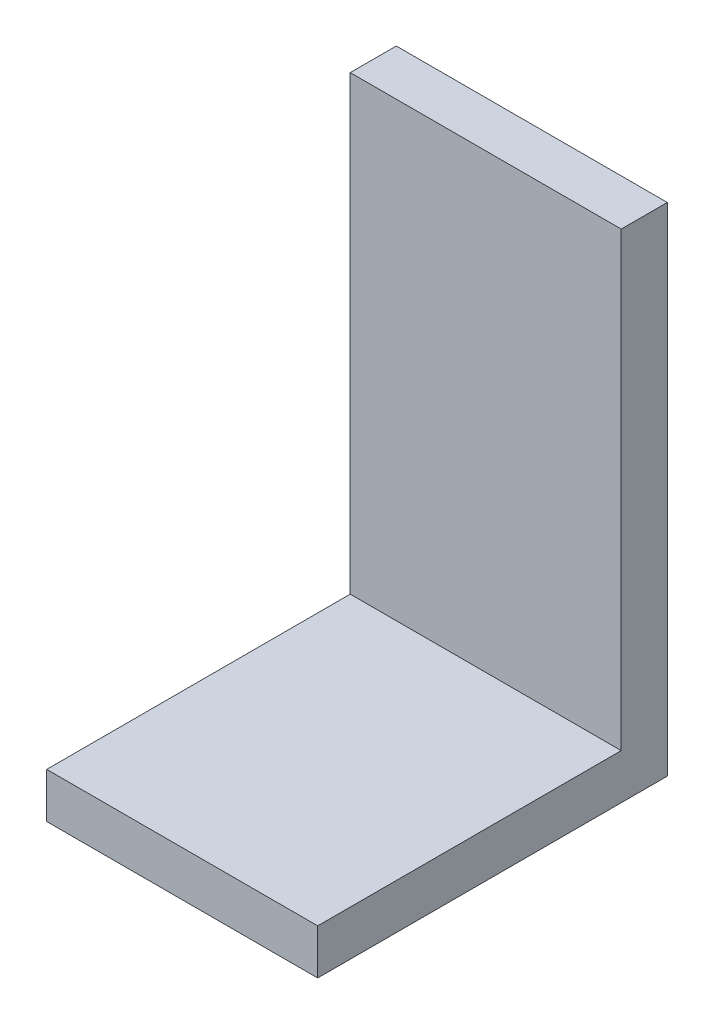
ISO-10303-21;
HEADER;
FILE_DESCRIPTION(('STEP AP214'),'2;1');
FILE_NAME('part.step','',(''),(''),'','','');
FILE_SCHEMA(('AUTOMOTIVE_DESIGN { 1 0 10303 214 1 1 1 1 }'));
ENDSEC;
DATA;
#1=APPLICATION_CONTEXT('core data for automotive mechanical design processes');
#2=APPLICATION_PROTOCOL_DEFINITION('international standard','automotive_design',2000,#1);
#3=PRODUCT_CONTEXT('',#1,'mechanical');
#4=PRODUCT('Part','Part','',(#3));
#5=PRODUCT_RELATED_PRODUCT_CATEGORY('part','',(#4));
#6=PRODUCT_DEFINITION_FORMATION('','',#4);
#7=PRODUCT_DEFINITION_CONTEXT('part definition',#1,'design');
#8=PRODUCT_DEFINITION('design','',#6,#7);
#9=PRODUCT_DEFINITION_SHAPE('','',#8);
#10=(LENGTH_UNIT() NAMED_UNIT(*) SI_UNIT(.MILLI.,.METRE.));
#11=(NAMED_UNIT(*) PLANE_ANGLE_UNIT() SI_UNIT($,.RADIAN.));
#12=(NAMED_UNIT(*) SI_UNIT($,.STERADIAN.) SOLID_ANGLE_UNIT());
#13=UNCERTAINTY_MEASURE_WITH_UNIT(LENGTH_MEASURE(1.E-05),#10,'distance_accuracy_value','');
#14=(GEOMETRIC_REPRESENTATION_CONTEXT(3) GLOBAL_UNCERTAINTY_ASSIGNED_CONTEXT((#13)) GLOBAL_UNIT_ASSIGNED_CONTEXT((#10,
#11,#12)) REPRESENTATION_CONTEXT('',''));
#15=CARTESIAN_POINT('',(0.,0.,0.));
#16=DIRECTION('',(0.,0.,1.));
#17=DIRECTION('',(1.,0.,0.));
#18=AXIS2_PLACEMENT_3D('',#15,#16,#17);
#19=CARTESIAN_POINT('',(1.9,-4.55,0.));
#20=DIRECTION('',(1.,0.,0.));
#21=DIRECTION('',(0.,0.,1.));
#22=AXIS2_PLACEMENT_3D('',#19,#20,#21);
#23=PLANE('',#22);
#24=DIRECTION('',(0.,-1.,0.));
#25=VECTOR('',#24,1.);
#26=CARTESIAN_POINT('',(1.9,-4.,0.));
#27=LINE('',#26,#25);
#28=CARTESIAN_POINT('',(1.9,-4.,0.));
#29=VERTEX_POINT('',#28);
#30=CARTESIAN_POINT('',(1.9,-4.55,0.));
#31=VERTEX_POINT('',#30);
#32=EDGE_CURVE('E11',#29,#31,#27,.T.);
#33=ORIENTED_EDGE('',*,*,#32,.F.);
#34=DIRECTION('',(0.,0.,-1.));
#35=VECTOR('',#34,1.);
#36=CARTESIAN_POINT('',(1.9,-4.,0.051));
#37=LINE('',#36,#35);
#38=CARTESIAN_POINT('',(1.9,-4.,0.051));
#39=VERTEX_POINT('',#38);
#40=EDGE_CURVE('E24',#39,#29,#37,.T.);
#41=ORIENTED_EDGE('',*,*,#40,.F.);
#42=DIRECTION('',(0.,1.,0.));
#43=VECTOR('',#42,1.);
#44=CARTESIAN_POINT('',(1.9,-4.5,0.051));
#45=LINE('',#44,#43);
#46=CARTESIAN_POINT('',(1.9,-4.5,0.051));
#47=VERTEX_POINT('',#46);
#48=EDGE_CURVE('E87',#47,#39,#45,.T.);
#49=ORIENTED_EDGE('',*,*,#48,.F.);
#50=DIRECTION('',(0.,0.,-1.));
#51=VECTOR('',#50,1.);
#52=CARTESIAN_POINT('',(1.9,-4.5,0.387));
#53=LINE('',#52,#51);
#54=CARTESIAN_POINT('',(1.9,-4.5,0.387));
#55=VERTEX_POINT('',#54);
#56=EDGE_CURVE('E114',#55,#47,#53,.T.);
#57=ORIENTED_EDGE('',*,*,#56,.F.);
#58=DIRECTION('',(0.,1.,0.));
#59=VECTOR('',#58,1.);
#60=CARTESIAN_POINT('',(1.9,-4.55,0.387));
#61=LINE('',#60,#59);
#62=CARTESIAN_POINT('',(1.9,-4.55,0.387));
#63=VERTEX_POINT('',#62);
#64=EDGE_CURVE('E111',#63,#55,#61,.T.);
#65=ORIENTED_EDGE('',*,*,#64,.F.);
#66=DIRECTION('',(0.,0.,1.));
#67=VECTOR('',#66,1.);
#68=CARTESIAN_POINT('',(1.9,-4.55,0.));
#69=LINE('',#68,#67);
#70=EDGE_CURVE('E108',#31,#63,#69,.T.);
#71=ORIENTED_EDGE('',*,*,#70,.F.);
#72=EDGE_LOOP('',(#33,#41,#49,#57,#65,#71));
#73=FACE_BOUND('',#72,.T.);
#74=ADVANCED_FACE('F17',(#73),#23,.T.);
#75=CARTESIAN_POINT('',(1.6,-4.,0.));
#76=DIRECTION('',(-1.,0.,0.));
#77=DIRECTION('',(0.,0.,1.));
#78=AXIS2_PLACEMENT_3D('',#75,#76,#77);
#79=PLANE('',#78);
#80=DIRECTION('',(0.,1.,0.));
#81=VECTOR('',#80,1.);
#82=CARTESIAN_POINT('',(1.6,-4.55,0.));
#83=LINE('',#82,#81);
#84=CARTESIAN_POINT('',(1.6,-4.55,0.));
#85=VERTEX_POINT('',#84);
#86=CARTESIAN_POINT('',(1.6,-4.,0.));
#87=VERTEX_POINT('',#86);
#88=EDGE_CURVE('E106',#85,#87,#83,.T.);
#89=ORIENTED_EDGE('',*,*,#88,.F.);
#90=DIRECTION('',(0.,0.,-1.));
#91=VECTOR('',#90,1.);
#92=CARTESIAN_POINT('',(1.6,-4.55,0.387));
#93=LINE('',#92,#91);
#94=CARTESIAN_POINT('',(1.6,-4.55,0.387));
#95=VERTEX_POINT('',#94);
#96=EDGE_CURVE('E103',#95,#85,#93,.T.);
#97=ORIENTED_EDGE('',*,*,#96,.F.);
#98=DIRECTION('',(0.,-1.,0.));
#99=VECTOR('',#98,1.);
#100=CARTESIAN_POINT('',(1.6,-4.5,0.387));
#101=LINE('',#100,#99);
#102=CARTESIAN_POINT('',(1.6,-4.5,0.387));
#103=VERTEX_POINT('',#102);
#104=EDGE_CURVE('E100',#103,#95,#101,.T.);
#105=ORIENTED_EDGE('',*,*,#104,.F.);
#106=DIRECTION('',(0.,0.,1.));
#107=VECTOR('',#106,1.);
#108=CARTESIAN_POINT('',(1.6,-4.5,0.051));
#109=LINE('',#108,#107);
#110=CARTESIAN_POINT('',(1.6,-4.5,0.051));
#111=VERTEX_POINT('',#110);
#112=EDGE_CURVE('E72',#111,#103,#109,.T.);
#113=ORIENTED_EDGE('',*,*,#112,.F.);
#114=DIRECTION('',(0.,-1.,0.));
#115=VECTOR('',#114,1.);
#116=CARTESIAN_POINT('',(1.6,-4.,0.051));
#117=LINE('',#116,#115);
#118=CARTESIAN_POINT('',(1.6,-4.,0.051));
#119=VERTEX_POINT('',#118);
#120=EDGE_CURVE('E66',#119,#111,#117,.T.);
#121=ORIENTED_EDGE('',*,*,#120,.F.);
#122=DIRECTION('',(0.,0.,1.));
#123=VECTOR('',#122,1.);
#124=CARTESIAN_POINT('',(1.6,-4.,0.));
#125=LINE('',#124,#123);
#126=EDGE_CURVE('E69',#87,#119,#125,.T.);
#127=ORIENTED_EDGE('',*,*,#126,.F.);
#128=EDGE_LOOP('',(#89,#97,#105,#113,#121,#127));
#129=FACE_BOUND('',#128,.T.);
#130=ADVANCED_FACE('F68',(#129),#79,.T.);
#131=CARTESIAN_POINT('',(1.9,-4.55,0.387));
#132=DIRECTION('',(0.,0.,1.));
#133=DIRECTION('',(0.,1.,0.));
#134=AXIS2_PLACEMENT_3D('',#131,#132,#133);
#135=PLANE('',#134);
#136=ORIENTED_EDGE('',*,*,#64,.T.);
#137=DIRECTION('',(1.,0.,0.));
#138=VECTOR('',#137,1.);
#139=CARTESIAN_POINT('',(1.6,-4.5,0.387));
#140=LINE('',#139,#138);
#141=EDGE_CURVE('E83',#103,#55,#140,.T.);
#142=ORIENTED_EDGE('',*,*,#141,.F.);
#143=ORIENTED_EDGE('',*,*,#104,.T.);
#144=DIRECTION('',(-1.,0.,0.));
#145=VECTOR('',#144,1.);
#146=CARTESIAN_POINT('',(1.9,-4.55,0.387));
#147=LINE('',#146,#145);
#148=EDGE_CURVE('E88',#63,#95,#147,.T.);
#149=ORIENTED_EDGE('',*,*,#148,.F.);
#150=EDGE_LOOP('',(#136,#142,#143,#149));
#151=FACE_BOUND('',#150,.T.);
#152=ADVANCED_FACE('F125',(#151),#135,.T.);
#153=CARTESIAN_POINT('',(1.9,-4.5,0.051));
#154=DIRECTION('',(0.,0.,1.));
#155=DIRECTION('',(0.,1.,0.));
#156=AXIS2_PLACEMENT_3D('',#153,#154,#155);
#157=PLANE('',#156);
#158=ORIENTED_EDGE('',*,*,#48,.T.);
#159=DIRECTION('',(1.,0.,0.));
#160=VECTOR('',#159,1.);
#161=CARTESIAN_POINT('',(1.6,-4.,0.051));
#162=LINE('',#161,#160);
#163=EDGE_CURVE('E81',#119,#39,#162,.T.);
#164=ORIENTED_EDGE('',*,*,#163,.F.);
#165=ORIENTED_EDGE('',*,*,#120,.T.);
#166=DIRECTION('',(-1.,0.,0.));
#167=VECTOR('',#166,1.);
#168=CARTESIAN_POINT('',(1.9,-4.5,0.051));
#169=LINE('',#168,#167);
#170=EDGE_CURVE('E89',#47,#111,#169,.T.);
#171=ORIENTED_EDGE('',*,*,#170,.F.);
#172=EDGE_LOOP('',(#158,#164,#165,#171));
#173=FACE_BOUND('',#172,.T.);
#174=ADVANCED_FACE('F86',(#173),#157,.T.);
#175=CARTESIAN_POINT('',(1.6,-4.55,0.));
#176=DIRECTION('',(0.,-1.,0.));
#177=DIRECTION('',(0.,0.,1.));
#178=AXIS2_PLACEMENT_3D('',#175,#176,#177);
#179=PLANE('',#178);
#180=DIRECTION('',(-1.,0.,0.));
#181=VECTOR('',#180,1.);
#182=CARTESIAN_POINT('',(1.9,-4.55,0.));
#183=LINE('',#182,#181);
#184=EDGE_CURVE('E93',#31,#85,#183,.T.);
#185=ORIENTED_EDGE('',*,*,#184,.F.);
#186=ORIENTED_EDGE('',*,*,#70,.T.);
#187=ORIENTED_EDGE('',*,*,#148,.T.);
#188=ORIENTED_EDGE('',*,*,#96,.T.);
#189=EDGE_LOOP('',(#185,#186,#187,#188));
#190=FACE_BOUND('',#189,.T.);
#191=ADVANCED_FACE('F121',(#190),#179,.T.);
#192=CARTESIAN_POINT('',(1.9,-4.,0.));
#193=DIRECTION('',(0.,1.,0.));
#194=DIRECTION('',(0.,0.,1.));
#195=AXIS2_PLACEMENT_3D('',#192,#193,#194);
#196=PLANE('',#195);
#197=DIRECTION('',(1.,0.,0.));
#198=VECTOR('',#197,1.);
#199=CARTESIAN_POINT('',(1.6,-4.,0.));
#200=LINE('',#199,#198);
#201=EDGE_CURVE('E82',#87,#29,#200,.T.);
#202=ORIENTED_EDGE('',*,*,#201,.F.);
#203=ORIENTED_EDGE('',*,*,#126,.T.);
#204=ORIENTED_EDGE('',*,*,#163,.T.);
#205=ORIENTED_EDGE('',*,*,#40,.T.);
#206=EDGE_LOOP('',(#202,#203,#204,#205));
#207=FACE_BOUND('',#206,.T.);
#208=ADVANCED_FACE('F80',(#207),#196,.T.);
#209=CARTESIAN_POINT('',(1.9,-4.5,0.051));
#210=DIRECTION('',(0.,1.,0.));
#211=DIRECTION('',(0.,0.,1.));
#212=AXIS2_PLACEMENT_3D('',#209,#210,#211);
#213=PLANE('',#212);
#214=ORIENTED_EDGE('',*,*,#170,.T.);
#215=ORIENTED_EDGE('',*,*,#112,.T.);
#216=ORIENTED_EDGE('',*,*,#141,.T.);
#217=ORIENTED_EDGE('',*,*,#56,.T.);
#218=EDGE_LOOP('',(#214,#215,#216,#217));
#219=FACE_BOUND('',#218,.T.);
#220=ADVANCED_FACE('F127',(#219),#213,.T.);
#221=CARTESIAN_POINT('',(1.6,-4.55,0.));
#222=DIRECTION('',(0.,0.,-1.));
#223=DIRECTION('',(0.,1.,0.));
#224=AXIS2_PLACEMENT_3D('',#221,#222,#223);
#225=PLANE('',#224);
#226=ORIENTED_EDGE('',*,*,#88,.T.);
#227=ORIENTED_EDGE('',*,*,#201,.T.);
#228=ORIENTED_EDGE('',*,*,#32,.T.);
#229=ORIENTED_EDGE('',*,*,#184,.T.);
#230=EDGE_LOOP('',(#226,#227,#228,#229));
#231=FACE_BOUND('',#230,.T.);
#232=ADVANCED_FACE('F117',(#231),#225,.T.);
#233=CLOSED_SHELL('',(#74,#130,#152,#174,#191,#208,#220,#232));
#234=MANIFOLD_SOLID_BREP('B1',#233);
#235=ADVANCED_BREP_SHAPE_REPRESENTATION('',(#18,#234),#14);
#236=SHAPE_DEFINITION_REPRESENTATION(#9,#235);
ENDSEC;
END-ISO-10303-21;
